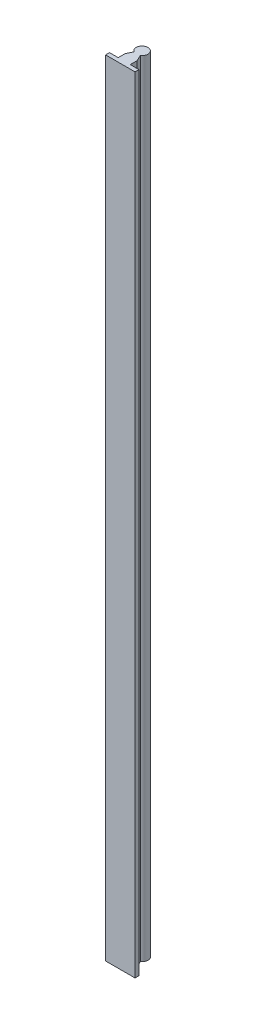
ISO-10303-21;
HEADER;
FILE_DESCRIPTION(('STEP AP214'),'2;1');
FILE_NAME('part.step','',(''),(''),'','','');
FILE_SCHEMA(('AUTOMOTIVE_DESIGN { 1 0 10303 214 1 1 1 1 }'));
ENDSEC;
DATA;
#1=APPLICATION_CONTEXT('core data for automotive mechanical design processes');
#2=APPLICATION_PROTOCOL_DEFINITION('international standard','automotive_design',2000,#1);
#3=PRODUCT_CONTEXT('',#1,'mechanical');
#4=PRODUCT('Part','Part','',(#3));
#5=PRODUCT_RELATED_PRODUCT_CATEGORY('part','',(#4));
#6=PRODUCT_DEFINITION_FORMATION('','',#4);
#7=PRODUCT_DEFINITION_CONTEXT('part definition',#1,'design');
#8=PRODUCT_DEFINITION('design','',#6,#7);
#9=PRODUCT_DEFINITION_SHAPE('','',#8);
#10=(LENGTH_UNIT() NAMED_UNIT(*) SI_UNIT(.MILLI.,.METRE.));
#11=(NAMED_UNIT(*) PLANE_ANGLE_UNIT() SI_UNIT($,.RADIAN.));
#12=(NAMED_UNIT(*) SI_UNIT($,.STERADIAN.) SOLID_ANGLE_UNIT());
#13=UNCERTAINTY_MEASURE_WITH_UNIT(LENGTH_MEASURE(1.E-05),#10,'distance_accuracy_value','');
#14=(GEOMETRIC_REPRESENTATION_CONTEXT(3) GLOBAL_UNCERTAINTY_ASSIGNED_CONTEXT((#13)) GLOBAL_UNIT_ASSIGNED_CONTEXT((#10,
#11,#12)) REPRESENTATION_CONTEXT('',''));
#15=CARTESIAN_POINT('',(0.,0.,0.));
#16=DIRECTION('',(0.,0.,1.));
#17=DIRECTION('',(1.,0.,0.));
#18=AXIS2_PLACEMENT_3D('',#15,#16,#17);
#19=CARTESIAN_POINT('',(-15.,800.,22.2));
#20=DIRECTION('',(0.,0.,-1.));
#21=DIRECTION('',(-1.,0.,0.));
#22=AXIS2_PLACEMENT_3D('',#19,#20,#21);
#23=PLANE('',#22);
#24=DIRECTION('',(1.,0.,0.));
#25=VECTOR('',#24,1.);
#26=CARTESIAN_POINT('',(-15.,0.,22.2));
#27=LINE('',#26,#25);
#28=CARTESIAN_POINT('',(-15.,0.,22.2));
#29=VERTEX_POINT('',#28);
#30=CARTESIAN_POINT('',(15.,0.,22.2));
#31=VERTEX_POINT('',#30);
#32=EDGE_CURVE('E152',#29,#31,#27,.T.);
#33=ORIENTED_EDGE('',*,*,#32,.T.);
#34=DIRECTION('',(0.,-1.,0.));
#35=VECTOR('',#34,1.);
#36=CARTESIAN_POINT('',(15.,800.,22.2));
#37=LINE('',#36,#35);
#38=CARTESIAN_POINT('',(15.,800.,22.2));
#39=VERTEX_POINT('',#38);
#40=EDGE_CURVE('E11',#39,#31,#37,.T.);
#41=ORIENTED_EDGE('',*,*,#40,.F.);
#42=DIRECTION('',(1.,0.,0.));
#43=VECTOR('',#42,1.);
#44=CARTESIAN_POINT('',(-15.,800.,22.2));
#45=LINE('',#44,#43);
#46=CARTESIAN_POINT('',(-15.,800.,22.2));
#47=VERTEX_POINT('',#46);
#48=EDGE_CURVE('E180',#47,#39,#45,.T.);
#49=ORIENTED_EDGE('',*,*,#48,.F.);
#50=DIRECTION('',(0.,-1.,0.));
#51=VECTOR('',#50,1.);
#52=CARTESIAN_POINT('',(-15.,800.,22.2));
#53=LINE('',#52,#51);
#54=EDGE_CURVE('E148',#47,#29,#53,.T.);
#55=ORIENTED_EDGE('',*,*,#54,.T.);
#56=EDGE_LOOP('',(#33,#41,#49,#55));
#57=FACE_BOUND('',#56,.T.);
#58=ADVANCED_FACE('F39',(#57),#23,.F.);
#59=CARTESIAN_POINT('',(15.,800.,18.2));
#60=DIRECTION('',(-1.,0.,0.));
#61=DIRECTION('',(0.,0.,1.));
#62=AXIS2_PLACEMENT_3D('',#59,#60,#61);
#63=PLANE('',#62);
#64=DIRECTION('',(0.,0.,-1.));
#65=VECTOR('',#64,1.);
#66=CARTESIAN_POINT('',(15.,0.,18.2));
#67=LINE('',#66,#65);
#68=CARTESIAN_POINT('',(15.,0.,18.2));
#69=VERTEX_POINT('',#68);
#70=EDGE_CURVE('E156',#31,#69,#67,.T.);
#71=ORIENTED_EDGE('',*,*,#70,.T.);
#72=DIRECTION('',(0.,-1.,0.));
#73=VECTOR('',#72,1.);
#74=CARTESIAN_POINT('',(15.,800.,18.2));
#75=LINE('',#74,#73);
#76=CARTESIAN_POINT('',(15.,800.,18.2));
#77=VERTEX_POINT('',#76);
#78=EDGE_CURVE('E48',#77,#69,#75,.T.);
#79=ORIENTED_EDGE('',*,*,#78,.F.);
#80=DIRECTION('',(0.,0.,-1.));
#81=VECTOR('',#80,1.);
#82=CARTESIAN_POINT('',(15.,800.,18.2));
#83=LINE('',#82,#81);
#84=EDGE_CURVE('E105',#39,#77,#83,.T.);
#85=ORIENTED_EDGE('',*,*,#84,.F.);
#86=ORIENTED_EDGE('',*,*,#40,.T.);
#87=EDGE_LOOP('',(#71,#79,#85,#86));
#88=FACE_BOUND('',#87,.T.);
#89=ADVANCED_FACE('F244',(#88),#63,.F.);
#90=CARTESIAN_POINT('',(6.15,800.,18.2));
#91=DIRECTION('',(0.,0.,1.));
#92=DIRECTION('',(1.,0.,0.));
#93=AXIS2_PLACEMENT_3D('',#90,#91,#92);
#94=PLANE('',#93);
#95=DIRECTION('',(-1.,0.,0.));
#96=VECTOR('',#95,1.);
#97=CARTESIAN_POINT('',(6.15,0.,18.2));
#98=LINE('',#97,#96);
#99=CARTESIAN_POINT('',(6.15,0.,18.2));
#100=VERTEX_POINT('',#99);
#101=EDGE_CURVE('E159',#69,#100,#98,.T.);
#102=ORIENTED_EDGE('',*,*,#101,.T.);
#103=DIRECTION('',(0.,-1.,0.));
#104=VECTOR('',#103,1.);
#105=CARTESIAN_POINT('',(6.15,800.,18.2));
#106=LINE('',#105,#104);
#107=CARTESIAN_POINT('',(6.15,800.,18.2));
#108=VERTEX_POINT('',#107);
#109=EDGE_CURVE('E199',#108,#100,#106,.T.);
#110=ORIENTED_EDGE('',*,*,#109,.F.);
#111=DIRECTION('',(-1.,0.,0.));
#112=VECTOR('',#111,1.);
#113=CARTESIAN_POINT('',(6.15,800.,18.2));
#114=LINE('',#113,#112);
#115=EDGE_CURVE('E209',#77,#108,#114,.T.);
#116=ORIENTED_EDGE('',*,*,#115,.F.);
#117=ORIENTED_EDGE('',*,*,#78,.T.);
#118=EDGE_LOOP('',(#102,#110,#116,#117));
#119=FACE_BOUND('',#118,.T.);
#120=ADVANCED_FACE('F207',(#119),#94,.F.);
#121=CARTESIAN_POINT('',(6.15,800.,11.2));
#122=DIRECTION('',(-1.,0.,0.));
#123=DIRECTION('',(0.,0.,1.));
#124=AXIS2_PLACEMENT_3D('',#121,#122,#123);
#125=PLANE('',#124);
#126=DIRECTION('',(0.,0.,-1.));
#127=VECTOR('',#126,1.);
#128=CARTESIAN_POINT('',(6.15,0.,11.2));
#129=LINE('',#128,#127);
#130=CARTESIAN_POINT('',(6.15,0.,11.2));
#131=VERTEX_POINT('',#130);
#132=EDGE_CURVE('E162',#100,#131,#129,.T.);
#133=ORIENTED_EDGE('',*,*,#132,.T.);
#134=DIRECTION('',(0.,-1.,0.));
#135=VECTOR('',#134,1.);
#136=CARTESIAN_POINT('',(6.15,800.,11.2));
#137=LINE('',#136,#135);
#138=CARTESIAN_POINT('',(6.15,800.,11.2));
#139=VERTEX_POINT('',#138);
#140=EDGE_CURVE('E195',#139,#131,#137,.T.);
#141=ORIENTED_EDGE('',*,*,#140,.F.);
#142=DIRECTION('',(0.,0.,-1.));
#143=VECTOR('',#142,1.);
#144=CARTESIAN_POINT('',(6.15,800.,11.2));
#145=LINE('',#144,#143);
#146=EDGE_CURVE('E228',#108,#139,#145,.T.);
#147=ORIENTED_EDGE('',*,*,#146,.F.);
#148=ORIENTED_EDGE('',*,*,#109,.T.);
#149=EDGE_LOOP('',(#133,#141,#147,#148));
#150=FACE_BOUND('',#149,.T.);
#151=ADVANCED_FACE('F218',(#150),#125,.F.);
#152=CARTESIAN_POINT('',(3.25,800.,5.043560250458));
#153=DIRECTION('',(-0.904657182620705,0.,0.426140096602946));
#154=DIRECTION('',(0.426140096602946,0.,0.904657182620705));
#155=AXIS2_PLACEMENT_3D('',#152,#153,#154);
#156=PLANE('',#155);
#157=DIRECTION('',(-0.426140096602946,0.,-0.904657182620705));
#158=VECTOR('',#157,1.);
#159=CARTESIAN_POINT('',(3.25,0.,5.043560250458));
#160=LINE('',#159,#158);
#161=CARTESIAN_POINT('',(3.25,0.,5.043560250458));
#162=VERTEX_POINT('',#161);
#163=EDGE_CURVE('E165',#131,#162,#160,.T.);
#164=ORIENTED_EDGE('',*,*,#163,.T.);
#165=DIRECTION('',(0.,-1.,0.));
#166=VECTOR('',#165,1.);
#167=CARTESIAN_POINT('',(3.25,800.,5.043560250458));
#168=LINE('',#167,#166);
#169=CARTESIAN_POINT('',(3.25,800.,5.043560250458));
#170=VERTEX_POINT('',#169);
#171=EDGE_CURVE('E191',#170,#162,#168,.T.);
#172=ORIENTED_EDGE('',*,*,#171,.F.);
#173=DIRECTION('',(-0.426140096602946,0.,-0.904657182620705));
#174=VECTOR('',#173,1.);
#175=CARTESIAN_POINT('',(3.25,800.,5.043560250458));
#176=LINE('',#175,#174);
#177=EDGE_CURVE('E224',#139,#170,#176,.T.);
#178=ORIENTED_EDGE('',*,*,#177,.F.);
#179=ORIENTED_EDGE('',*,*,#140,.T.);
#180=EDGE_LOOP('',(#164,#172,#178,#179));
#181=FACE_BOUND('',#180,.T.);
#182=ADVANCED_FACE('F222',(#181),#156,.F.);
#183=CARTESIAN_POINT('',(0.,800.,0.));
#184=DIRECTION('',(0.,-1.,0.));
#185=DIRECTION('',(0.,0.,-1.));
#186=AXIS2_PLACEMENT_3D('',#183,#184,#185);
#187=CYLINDRICAL_SURFACE('',#186,6.);
#188=CARTESIAN_POINT('',(0.,0.,0.));
#189=DIRECTION('',(0.,1.,0.));
#190=DIRECTION('',(0.,0.,1.));
#191=AXIS2_PLACEMENT_3D('',#188,#189,#190);
#192=CIRCLE('',#191,6.);
#193=CARTESIAN_POINT('',(-3.25,0.,5.043560250458));
#194=VERTEX_POINT('',#193);
#195=EDGE_CURVE('E168',#162,#194,#192,.T.);
#196=ORIENTED_EDGE('',*,*,#195,.T.);
#197=DIRECTION('',(0.,-1.,0.));
#198=VECTOR('',#197,1.);
#199=CARTESIAN_POINT('',(-3.25,800.,5.043560250458));
#200=LINE('',#199,#198);
#201=CARTESIAN_POINT('',(-3.25,800.,5.043560250458));
#202=VERTEX_POINT('',#201);
#203=EDGE_CURVE('E187',#202,#194,#200,.T.);
#204=ORIENTED_EDGE('',*,*,#203,.F.);
#205=CARTESIAN_POINT('',(0.,800.,0.));
#206=DIRECTION('',(0.,1.,0.));
#207=DIRECTION('',(0.,0.,1.));
#208=AXIS2_PLACEMENT_3D('',#205,#206,#207);
#209=CIRCLE('',#208,6.);
#210=EDGE_CURVE('E227',#170,#202,#209,.T.);
#211=ORIENTED_EDGE('',*,*,#210,.F.);
#212=ORIENTED_EDGE('',*,*,#171,.T.);
#213=EDGE_LOOP('',(#196,#204,#211,#212));
#214=FACE_BOUND('',#213,.T.);
#215=ADVANCED_FACE('F256',(#214),#187,.T.);
#216=CARTESIAN_POINT('',(-3.25,800.,5.043560250458));
#217=DIRECTION('',(0.904657182620705,0.,0.426140096602946));
#218=DIRECTION('',(0.426140096602946,0.,-0.904657182620705));
#219=AXIS2_PLACEMENT_3D('',#216,#217,#218);
#220=PLANE('',#219);
#221=DIRECTION('',(-0.426140096602946,0.,0.904657182620705));
#222=VECTOR('',#221,1.);
#223=CARTESIAN_POINT('',(-3.25,0.,5.043560250458));
#224=LINE('',#223,#222);
#225=CARTESIAN_POINT('',(-6.15,0.,11.2));
#226=VERTEX_POINT('',#225);
#227=EDGE_CURVE('E171',#194,#226,#224,.T.);
#228=ORIENTED_EDGE('',*,*,#227,.T.);
#229=DIRECTION('',(0.,-1.,0.));
#230=VECTOR('',#229,1.);
#231=CARTESIAN_POINT('',(-6.15,800.,11.2));
#232=LINE('',#231,#230);
#233=CARTESIAN_POINT('',(-6.15,800.,11.2));
#234=VERTEX_POINT('',#233);
#235=EDGE_CURVE('E141',#234,#226,#232,.T.);
#236=ORIENTED_EDGE('',*,*,#235,.F.);
#237=DIRECTION('',(-0.426140096602946,0.,0.904657182620705));
#238=VECTOR('',#237,1.);
#239=CARTESIAN_POINT('',(-3.25,800.,5.043560250458));
#240=LINE('',#239,#238);
#241=EDGE_CURVE('E130',#202,#234,#240,.T.);
#242=ORIENTED_EDGE('',*,*,#241,.F.);
#243=ORIENTED_EDGE('',*,*,#203,.T.);
#244=EDGE_LOOP('',(#228,#236,#242,#243));
#245=FACE_BOUND('',#244,.T.);
#246=ADVANCED_FACE('F259',(#245),#220,.F.);
#247=CARTESIAN_POINT('',(-6.15,800.,11.2));
#248=DIRECTION('',(1.,0.,0.));
#249=DIRECTION('',(0.,0.,-1.));
#250=AXIS2_PLACEMENT_3D('',#247,#248,#249);
#251=PLANE('',#250);
#252=DIRECTION('',(0.,0.,1.));
#253=VECTOR('',#252,1.);
#254=CARTESIAN_POINT('',(-6.15,0.,11.2));
#255=LINE('',#254,#253);
#256=CARTESIAN_POINT('',(-6.15,0.,18.2));
#257=VERTEX_POINT('',#256);
#258=EDGE_CURVE('E139',#226,#257,#255,.T.);
#259=ORIENTED_EDGE('',*,*,#258,.T.);
#260=DIRECTION('',(0.,-1.,0.));
#261=VECTOR('',#260,1.);
#262=CARTESIAN_POINT('',(-6.15,800.,18.2));
#263=LINE('',#262,#261);
#264=CARTESIAN_POINT('',(-6.15,800.,18.2));
#265=VERTEX_POINT('',#264);
#266=EDGE_CURVE('E136',#265,#257,#263,.T.);
#267=ORIENTED_EDGE('',*,*,#266,.F.);
#268=DIRECTION('',(0.,0.,1.));
#269=VECTOR('',#268,1.);
#270=CARTESIAN_POINT('',(-6.15,800.,11.2));
#271=LINE('',#270,#269);
#272=EDGE_CURVE('E124',#234,#265,#271,.T.);
#273=ORIENTED_EDGE('',*,*,#272,.F.);
#274=ORIENTED_EDGE('',*,*,#235,.T.);
#275=EDGE_LOOP('',(#259,#267,#273,#274));
#276=FACE_BOUND('',#275,.T.);
#277=ADVANCED_FACE('F137',(#276),#251,.F.);
#278=CARTESIAN_POINT('',(-6.15,800.,18.2));
#279=DIRECTION('',(0.,0.,1.));
#280=DIRECTION('',(1.,0.,0.));
#281=AXIS2_PLACEMENT_3D('',#278,#279,#280);
#282=PLANE('',#281);
#283=DIRECTION('',(-1.,0.,0.));
#284=VECTOR('',#283,1.);
#285=CARTESIAN_POINT('',(-6.15,0.,18.2));
#286=LINE('',#285,#284);
#287=CARTESIAN_POINT('',(-15.,0.,18.2));
#288=VERTEX_POINT('',#287);
#289=EDGE_CURVE('E91',#257,#288,#286,.T.);
#290=ORIENTED_EDGE('',*,*,#289,.T.);
#291=DIRECTION('',(0.,-1.,0.));
#292=VECTOR('',#291,1.);
#293=CARTESIAN_POINT('',(-15.,800.,18.2));
#294=LINE('',#293,#292);
#295=CARTESIAN_POINT('',(-15.,800.,18.2));
#296=VERTEX_POINT('',#295);
#297=EDGE_CURVE('E142',#296,#288,#294,.T.);
#298=ORIENTED_EDGE('',*,*,#297,.F.);
#299=DIRECTION('',(-1.,0.,0.));
#300=VECTOR('',#299,1.);
#301=CARTESIAN_POINT('',(-6.15,800.,18.2));
#302=LINE('',#301,#300);
#303=EDGE_CURVE('E128',#265,#296,#302,.T.);
#304=ORIENTED_EDGE('',*,*,#303,.F.);
#305=ORIENTED_EDGE('',*,*,#266,.T.);
#306=EDGE_LOOP('',(#290,#298,#304,#305));
#307=FACE_BOUND('',#306,.T.);
#308=ADVANCED_FACE('F144',(#307),#282,.F.);
#309=CARTESIAN_POINT('',(-15.,800.,18.2));
#310=DIRECTION('',(1.,0.,0.));
#311=DIRECTION('',(0.,0.,-1.));
#312=AXIS2_PLACEMENT_3D('',#309,#310,#311);
#313=PLANE('',#312);
#314=DIRECTION('',(0.,0.,1.));
#315=VECTOR('',#314,1.);
#316=CARTESIAN_POINT('',(-15.,0.,18.2));
#317=LINE('',#316,#315);
#318=EDGE_CURVE('E97',#288,#29,#317,.T.);
#319=ORIENTED_EDGE('',*,*,#318,.T.);
#320=ORIENTED_EDGE('',*,*,#54,.F.);
#321=DIRECTION('',(0.,0.,1.));
#322=VECTOR('',#321,1.);
#323=CARTESIAN_POINT('',(-15.,800.,18.2));
#324=LINE('',#323,#322);
#325=EDGE_CURVE('E56',#296,#47,#324,.T.);
#326=ORIENTED_EDGE('',*,*,#325,.F.);
#327=ORIENTED_EDGE('',*,*,#297,.T.);
#328=EDGE_LOOP('',(#319,#320,#326,#327));
#329=FACE_BOUND('',#328,.T.);
#330=ADVANCED_FACE('F268',(#329),#313,.F.);
#331=CARTESIAN_POINT('',(0.,800.,0.));
#332=DIRECTION('',(0.,1.,0.));
#333=DIRECTION('',(0.,0.,1.));
#334=AXIS2_PLACEMENT_3D('',#331,#332,#333);
#335=PLANE('',#334);
#336=ORIENTED_EDGE('',*,*,#48,.T.);
#337=ORIENTED_EDGE('',*,*,#84,.T.);
#338=ORIENTED_EDGE('',*,*,#115,.T.);
#339=ORIENTED_EDGE('',*,*,#146,.T.);
#340=ORIENTED_EDGE('',*,*,#177,.T.);
#341=ORIENTED_EDGE('',*,*,#210,.T.);
#342=ORIENTED_EDGE('',*,*,#241,.T.);
#343=ORIENTED_EDGE('',*,*,#272,.T.);
#344=ORIENTED_EDGE('',*,*,#303,.T.);
#345=ORIENTED_EDGE('',*,*,#325,.T.);
#346=EDGE_LOOP('',(#336,#337,#338,#339,#340,#341,#342,#343,#344,#345));
#347=FACE_BOUND('',#346,.T.);
#348=ADVANCED_FACE('F126',(#347),#335,.T.);
#349=CARTESIAN_POINT('',(0.,0.,0.));
#350=DIRECTION('',(0.,1.,0.));
#351=DIRECTION('',(0.,0.,1.));
#352=AXIS2_PLACEMENT_3D('',#349,#350,#351);
#353=PLANE('',#352);
#354=ORIENTED_EDGE('',*,*,#32,.F.);
#355=ORIENTED_EDGE('',*,*,#318,.F.);
#356=ORIENTED_EDGE('',*,*,#289,.F.);
#357=ORIENTED_EDGE('',*,*,#258,.F.);
#358=ORIENTED_EDGE('',*,*,#227,.F.);
#359=ORIENTED_EDGE('',*,*,#195,.F.);
#360=ORIENTED_EDGE('',*,*,#163,.F.);
#361=ORIENTED_EDGE('',*,*,#132,.F.);
#362=ORIENTED_EDGE('',*,*,#101,.F.);
#363=ORIENTED_EDGE('',*,*,#70,.F.);
#364=EDGE_LOOP('',(#354,#355,#356,#357,#358,#359,#360,#361,#362,#363));
#365=FACE_BOUND('',#364,.T.);
#366=ADVANCED_FACE('F213',(#365),#353,.F.);
#367=CLOSED_SHELL('',(#58,#89,#120,#151,#182,#215,#246,#277,#308,#330,#348,#366));
#368=MANIFOLD_SOLID_BREP('B2',#367);
#369=ADVANCED_BREP_SHAPE_REPRESENTATION('',(#18,#368),#14);
#370=SHAPE_DEFINITION_REPRESENTATION(#9,#369);
ENDSEC;
END-ISO-10303-21;
